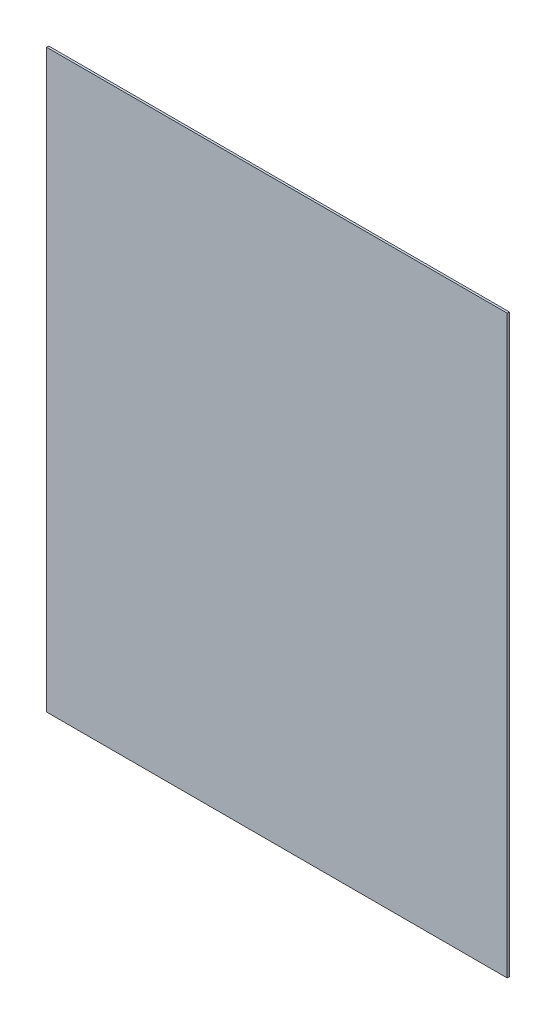
ISO-10303-21;
HEADER;
FILE_DESCRIPTION(('STEP AP214'),'2;1');
FILE_NAME('part.step','',(''),(''),'','','');
FILE_SCHEMA(('AUTOMOTIVE_DESIGN { 1 0 10303 214 1 1 1 1 }'));
ENDSEC;
DATA;
#1=APPLICATION_CONTEXT('core data for automotive mechanical design processes');
#2=APPLICATION_PROTOCOL_DEFINITION('international standard','automotive_design',2000,#1);
#3=PRODUCT_CONTEXT('',#1,'mechanical');
#4=PRODUCT('Part','Part','',(#3));
#5=PRODUCT_RELATED_PRODUCT_CATEGORY('part','',(#4));
#6=PRODUCT_DEFINITION_FORMATION('','',#4);
#7=PRODUCT_DEFINITION_CONTEXT('part definition',#1,'design');
#8=PRODUCT_DEFINITION('design','',#6,#7);
#9=PRODUCT_DEFINITION_SHAPE('','',#8);
#10=(LENGTH_UNIT() NAMED_UNIT(*) SI_UNIT(.MILLI.,.METRE.));
#11=(NAMED_UNIT(*) PLANE_ANGLE_UNIT() SI_UNIT($,.RADIAN.));
#12=(NAMED_UNIT(*) SI_UNIT($,.STERADIAN.) SOLID_ANGLE_UNIT());
#13=UNCERTAINTY_MEASURE_WITH_UNIT(LENGTH_MEASURE(1.E-05),#10,'distance_accuracy_value','');
#14=(GEOMETRIC_REPRESENTATION_CONTEXT(3) GLOBAL_UNCERTAINTY_ASSIGNED_CONTEXT((#13)) GLOBAL_UNIT_ASSIGNED_CONTEXT((#10,
#11,#12)) REPRESENTATION_CONTEXT('',''));
#15=CARTESIAN_POINT('',(0.,0.,0.));
#16=DIRECTION('',(0.,0.,1.));
#17=DIRECTION('',(1.,0.,0.));
#18=AXIS2_PLACEMENT_3D('',#15,#16,#17);
#19=CARTESIAN_POINT('',(0.,0.,3.));
#20=DIRECTION('',(-1.,0.,0.));
#21=DIRECTION('',(0.,0.,1.));
#22=AXIS2_PLACEMENT_3D('',#19,#20,#21);
#23=PLANE('',#22);
#24=DIRECTION('',(0.,1.,0.));
#25=VECTOR('',#24,1.);
#26=CARTESIAN_POINT('',(0.,0.,0.));
#27=LINE('',#26,#25);
#28=CARTESIAN_POINT('',(0.,0.,0.));
#29=VERTEX_POINT('',#28);
#30=CARTESIAN_POINT('',(0.,800.,0.));
#31=VERTEX_POINT('',#30);
#32=EDGE_CURVE('E96',#29,#31,#27,.T.);
#33=ORIENTED_EDGE('',*,*,#32,.T.);
#34=DIRECTION('',(0.,0.,-1.));
#35=VECTOR('',#34,1.);
#36=CARTESIAN_POINT('',(0.,800.,3.));
#37=LINE('',#36,#35);
#38=CARTESIAN_POINT('',(0.,800.,3.));
#39=VERTEX_POINT('',#38);
#40=EDGE_CURVE('E11',#39,#31,#37,.T.);
#41=ORIENTED_EDGE('',*,*,#40,.F.);
#42=DIRECTION('',(0.,1.,0.));
#43=VECTOR('',#42,1.);
#44=CARTESIAN_POINT('',(0.,0.,3.));
#45=LINE('',#44,#43);
#46=CARTESIAN_POINT('',(0.,0.,3.));
#47=VERTEX_POINT('',#46);
#48=EDGE_CURVE('E84',#47,#39,#45,.T.);
#49=ORIENTED_EDGE('',*,*,#48,.F.);
#50=DIRECTION('',(0.,0.,-1.));
#51=VECTOR('',#50,1.);
#52=CARTESIAN_POINT('',(0.,0.,3.));
#53=LINE('',#52,#51);
#54=EDGE_CURVE('E92',#47,#29,#53,.T.);
#55=ORIENTED_EDGE('',*,*,#54,.T.);
#56=EDGE_LOOP('',(#33,#41,#49,#55));
#57=FACE_BOUND('',#56,.T.);
#58=ADVANCED_FACE('F33',(#57),#23,.F.);
#59=CARTESIAN_POINT('',(0.,800.,3.));
#60=DIRECTION('',(0.,-1.,0.));
#61=DIRECTION('',(1.,0.,0.));
#62=AXIS2_PLACEMENT_3D('',#59,#60,#61);
#63=PLANE('',#62);
#64=DIRECTION('',(-1.,0.,0.));
#65=VECTOR('',#64,1.);
#66=CARTESIAN_POINT('',(0.,800.,0.));
#67=LINE('',#66,#65);
#68=CARTESIAN_POINT('',(-640.,800.,0.));
#69=VERTEX_POINT('',#68);
#70=EDGE_CURVE('E88',#31,#69,#67,.T.);
#71=ORIENTED_EDGE('',*,*,#70,.T.);
#72=DIRECTION('',(0.,0.,-1.));
#73=VECTOR('',#72,1.);
#74=CARTESIAN_POINT('',(-640.,800.,3.));
#75=LINE('',#74,#73);
#76=CARTESIAN_POINT('',(-640.,800.,3.));
#77=VERTEX_POINT('',#76);
#78=EDGE_CURVE('E41',#77,#69,#75,.T.);
#79=ORIENTED_EDGE('',*,*,#78,.F.);
#80=DIRECTION('',(-1.,0.,0.));
#81=VECTOR('',#80,1.);
#82=CARTESIAN_POINT('',(0.,800.,3.));
#83=LINE('',#82,#81);
#84=EDGE_CURVE('E79',#39,#77,#83,.T.);
#85=ORIENTED_EDGE('',*,*,#84,.F.);
#86=ORIENTED_EDGE('',*,*,#40,.T.);
#87=EDGE_LOOP('',(#71,#79,#85,#86));
#88=FACE_BOUND('',#87,.T.);
#89=ADVANCED_FACE('F87',(#88),#63,.F.);
#90=CARTESIAN_POINT('',(-640.,0.,3.));
#91=DIRECTION('',(1.,0.,0.));
#92=DIRECTION('',(0.,0.,-1.));
#93=AXIS2_PLACEMENT_3D('',#90,#91,#92);
#94=PLANE('',#93);
#95=DIRECTION('',(0.,-1.,0.));
#96=VECTOR('',#95,1.);
#97=CARTESIAN_POINT('',(-640.,0.,0.));
#98=LINE('',#97,#96);
#99=CARTESIAN_POINT('',(-640.,0.,0.));
#100=VERTEX_POINT('',#99);
#101=EDGE_CURVE('E66',#69,#100,#98,.T.);
#102=ORIENTED_EDGE('',*,*,#101,.T.);
#103=DIRECTION('',(0.,0.,-1.));
#104=VECTOR('',#103,1.);
#105=CARTESIAN_POINT('',(-640.,0.,3.));
#106=LINE('',#105,#104);
#107=CARTESIAN_POINT('',(-640.,0.,3.));
#108=VERTEX_POINT('',#107);
#109=EDGE_CURVE('E89',#108,#100,#106,.T.);
#110=ORIENTED_EDGE('',*,*,#109,.F.);
#111=DIRECTION('',(0.,-1.,0.));
#112=VECTOR('',#111,1.);
#113=CARTESIAN_POINT('',(-640.,0.,3.));
#114=LINE('',#113,#112);
#115=EDGE_CURVE('E82',#77,#108,#114,.T.);
#116=ORIENTED_EDGE('',*,*,#115,.F.);
#117=ORIENTED_EDGE('',*,*,#78,.T.);
#118=EDGE_LOOP('',(#102,#110,#116,#117));
#119=FACE_BOUND('',#118,.T.);
#120=ADVANCED_FACE('F90',(#119),#94,.F.);
#121=CARTESIAN_POINT('',(0.,0.,3.));
#122=DIRECTION('',(0.,1.,0.));
#123=DIRECTION('',(-1.,0.,0.));
#124=AXIS2_PLACEMENT_3D('',#121,#122,#123);
#125=PLANE('',#124);
#126=DIRECTION('',(1.,0.,0.));
#127=VECTOR('',#126,1.);
#128=CARTESIAN_POINT('',(0.,0.,0.));
#129=LINE('',#128,#127);
#130=EDGE_CURVE('E72',#100,#29,#129,.T.);
#131=ORIENTED_EDGE('',*,*,#130,.T.);
#132=ORIENTED_EDGE('',*,*,#54,.F.);
#133=DIRECTION('',(1.,0.,0.));
#134=VECTOR('',#133,1.);
#135=CARTESIAN_POINT('',(0.,0.,3.));
#136=LINE('',#135,#134);
#137=EDGE_CURVE('E49',#108,#47,#136,.T.);
#138=ORIENTED_EDGE('',*,*,#137,.F.);
#139=ORIENTED_EDGE('',*,*,#109,.T.);
#140=EDGE_LOOP('',(#131,#132,#138,#139));
#141=FACE_BOUND('',#140,.T.);
#142=ADVANCED_FACE('F103',(#141),#125,.F.);
#143=CARTESIAN_POINT('',(0.,800.,3.));
#144=DIRECTION('',(0.,0.,1.));
#145=DIRECTION('',(1.,0.,0.));
#146=AXIS2_PLACEMENT_3D('',#143,#144,#145);
#147=PLANE('',#146);
#148=ORIENTED_EDGE('',*,*,#48,.T.);
#149=ORIENTED_EDGE('',*,*,#84,.T.);
#150=ORIENTED_EDGE('',*,*,#115,.T.);
#151=ORIENTED_EDGE('',*,*,#137,.T.);
#152=EDGE_LOOP('',(#148,#149,#150,#151));
#153=FACE_BOUND('',#152,.T.);
#154=ADVANCED_FACE('F80',(#153),#147,.T.);
#155=CARTESIAN_POINT('',(0.,800.,0.));
#156=DIRECTION('',(0.,0.,1.));
#157=DIRECTION('',(1.,0.,0.));
#158=AXIS2_PLACEMENT_3D('',#155,#156,#157);
#159=PLANE('',#158);
#160=ORIENTED_EDGE('',*,*,#32,.F.);
#161=ORIENTED_EDGE('',*,*,#130,.F.);
#162=ORIENTED_EDGE('',*,*,#101,.F.);
#163=ORIENTED_EDGE('',*,*,#70,.F.);
#164=EDGE_LOOP('',(#160,#161,#162,#163));
#165=FACE_BOUND('',#164,.T.);
#166=ADVANCED_FACE('F106',(#165),#159,.F.);
#167=CLOSED_SHELL('',(#58,#89,#120,#142,#154,#166));
#168=MANIFOLD_SOLID_BREP('B2',#167);
#169=ADVANCED_BREP_SHAPE_REPRESENTATION('',(#18,#168),#14);
#170=SHAPE_DEFINITION_REPRESENTATION(#9,#169);
ENDSEC;
END-ISO-10303-21;
